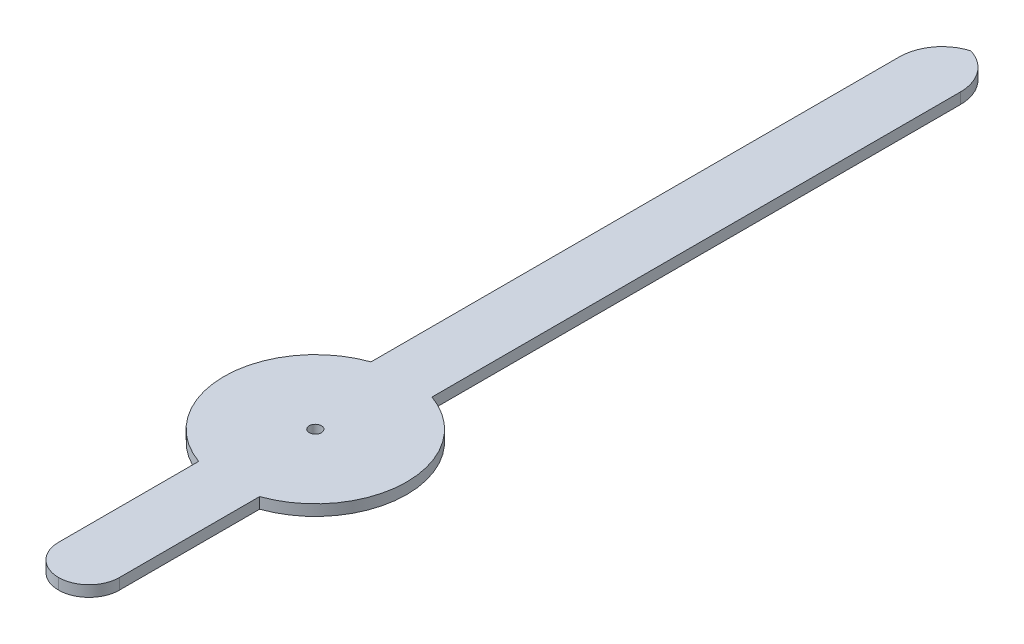
ISO-10303-21;
HEADER;
FILE_DESCRIPTION(('STEP AP214'),'2;1');
FILE_NAME('part.step','',(''),(''),'','','');
FILE_SCHEMA(('AUTOMOTIVE_DESIGN { 1 0 10303 214 1 1 1 1 }'));
ENDSEC;
DATA;
#1=APPLICATION_CONTEXT('core data for automotive mechanical design processes');
#2=APPLICATION_PROTOCOL_DEFINITION('international standard','automotive_design',2000,#1);
#3=PRODUCT_CONTEXT('',#1,'mechanical');
#4=PRODUCT('Part','Part','',(#3));
#5=PRODUCT_RELATED_PRODUCT_CATEGORY('part','',(#4));
#6=PRODUCT_DEFINITION_FORMATION('','',#4);
#7=PRODUCT_DEFINITION_CONTEXT('part definition',#1,'design');
#8=PRODUCT_DEFINITION('design','',#6,#7);
#9=PRODUCT_DEFINITION_SHAPE('','',#8);
#10=(LENGTH_UNIT() NAMED_UNIT(*) SI_UNIT(.MILLI.,.METRE.));
#11=(NAMED_UNIT(*) PLANE_ANGLE_UNIT() SI_UNIT($,.RADIAN.));
#12=(NAMED_UNIT(*) SI_UNIT($,.STERADIAN.) SOLID_ANGLE_UNIT());
#13=UNCERTAINTY_MEASURE_WITH_UNIT(LENGTH_MEASURE(1.E-05),#10,'distance_accuracy_value','');
#14=(GEOMETRIC_REPRESENTATION_CONTEXT(3) GLOBAL_UNCERTAINTY_ASSIGNED_CONTEXT((#13)) GLOBAL_UNIT_ASSIGNED_CONTEXT((#10,
#11,#12)) REPRESENTATION_CONTEXT('',''));
#15=CARTESIAN_POINT('',(0.,0.,0.));
#16=DIRECTION('',(0.,0.,1.));
#17=DIRECTION('',(1.,0.,0.));
#18=AXIS2_PLACEMENT_3D('',#15,#16,#17);
#19=CARTESIAN_POINT('',(0.,0.18,0.));
#20=DIRECTION('',(0.,1.,0.));
#21=DIRECTION('',(0.,0.,1.));
#22=AXIS2_PLACEMENT_3D('',#19,#20,#21);
#23=PLANE('',#22);
#24=CARTESIAN_POINT('',(-0.200000000000001,0.18,-10.0857864376269));
#25=DIRECTION('',(0.,1.,0.));
#26=DIRECTION('',(0.,0.,1.));
#27=AXIS2_PLACEMENT_3D('',#24,#25,#26);
#28=CIRCLE('',#27,0.7);
#29=CARTESIAN_POINT('',(0.499999999999999,0.18,-10.0857864376269));
#30=VERTEX_POINT('',#29);
#31=CARTESIAN_POINT('',(0.,0.18,-10.7566068308768));
#32=VERTEX_POINT('',#31);
#33=EDGE_CURVE('E60',#30,#32,#28,.T.);
#34=ORIENTED_EDGE('',*,*,#33,.T.);
#35=CARTESIAN_POINT('',(0.200000000000001,0.18,-10.0857864376269));
#36=DIRECTION('',(0.,1.,0.));
#37=DIRECTION('',(0.,0.,1.));
#38=AXIS2_PLACEMENT_3D('',#35,#36,#37);
#39=CIRCLE('',#38,0.7);
#40=CARTESIAN_POINT('',(-0.499999999999999,0.18,-10.0857864376269));
#41=VERTEX_POINT('',#40);
#42=EDGE_CURVE('E53',#32,#41,#39,.T.);
#43=ORIENTED_EDGE('',*,*,#42,.T.);
#44=DIRECTION('',(0.,0.,1.));
#45=VECTOR('',#44,1.);
#46=CARTESIAN_POINT('',(-0.499999999999999,0.18,-1.4142135623731));
#47=LINE('',#46,#45);
#48=CARTESIAN_POINT('',(-0.499999999999999,0.18,-1.4142135623731));
#49=VERTEX_POINT('',#48);
#50=EDGE_CURVE('E150',#41,#49,#47,.T.);
#51=ORIENTED_EDGE('',*,*,#50,.T.);
#52=CARTESIAN_POINT('',(0.,0.18,0.));
#53=DIRECTION('',(0.,1.,0.));
#54=DIRECTION('',(0.,0.,1.));
#55=AXIS2_PLACEMENT_3D('',#52,#53,#54);
#56=CIRCLE('',#55,1.5);
#57=CARTESIAN_POINT('',(-0.499999999999999,0.18,1.4142135623731));
#58=VERTEX_POINT('',#57);
#59=EDGE_CURVE('E156',#49,#58,#56,.T.);
#60=ORIENTED_EDGE('',*,*,#59,.T.);
#61=DIRECTION('',(0.,0.,1.));
#62=VECTOR('',#61,1.);
#63=CARTESIAN_POINT('',(-0.499999999999999,0.18,4.2142135623731));
#64=LINE('',#63,#62);
#65=CARTESIAN_POINT('',(-0.499999999999999,0.18,3.7142135623731));
#66=VERTEX_POINT('',#65);
#67=EDGE_CURVE('E159',#58,#66,#64,.T.);
#68=ORIENTED_EDGE('',*,*,#67,.T.);
#69=CARTESIAN_POINT('',(0.,0.18,3.7142135623731));
#70=DIRECTION('',(0.,1.,0.));
#71=DIRECTION('',(0.,0.,1.));
#72=AXIS2_PLACEMENT_3D('',#69,#70,#71);
#73=CIRCLE('',#72,0.5);
#74=CARTESIAN_POINT('',(0.,0.18,4.2142135623731));
#75=VERTEX_POINT('',#74);
#76=EDGE_CURVE('E202',#66,#75,#73,.T.);
#77=ORIENTED_EDGE('',*,*,#76,.T.);
#78=CARTESIAN_POINT('',(0.,0.18,3.7142135623731));
#79=DIRECTION('',(0.,1.,0.));
#80=DIRECTION('',(0.,0.,1.));
#81=AXIS2_PLACEMENT_3D('',#78,#79,#80);
#82=CIRCLE('',#81,0.5);
#83=CARTESIAN_POINT('',(0.499999999999999,0.18,3.7142135623731));
#84=VERTEX_POINT('',#83);
#85=EDGE_CURVE('E127',#75,#84,#82,.T.);
#86=ORIENTED_EDGE('',*,*,#85,.T.);
#87=DIRECTION('',(0.,0.,-1.));
#88=VECTOR('',#87,1.);
#89=CARTESIAN_POINT('',(0.499999999999999,0.18,4.2142135623731));
#90=LINE('',#89,#88);
#91=CARTESIAN_POINT('',(0.499999999999999,0.18,1.4142135623731));
#92=VERTEX_POINT('',#91);
#93=EDGE_CURVE('E120',#84,#92,#90,.T.);
#94=ORIENTED_EDGE('',*,*,#93,.T.);
#95=CARTESIAN_POINT('',(0.,0.18,0.));
#96=DIRECTION('',(0.,1.,0.));
#97=DIRECTION('',(0.,0.,1.));
#98=AXIS2_PLACEMENT_3D('',#95,#96,#97);
#99=CIRCLE('',#98,1.5);
#100=CARTESIAN_POINT('',(0.499999999999999,0.18,-1.4142135623731));
#101=VERTEX_POINT('',#100);
#102=EDGE_CURVE('E124',#92,#101,#99,.T.);
#103=ORIENTED_EDGE('',*,*,#102,.T.);
#104=DIRECTION('',(0.,0.,-1.));
#105=VECTOR('',#104,1.);
#106=CARTESIAN_POINT('',(0.499999999999999,0.18,-1.4142135623731));
#107=LINE('',#106,#105);
#108=EDGE_CURVE('E147',#101,#30,#107,.T.);
#109=ORIENTED_EDGE('',*,*,#108,.T.);
#110=EDGE_LOOP('',(#34,#43,#51,#60,#68,#77,#86,#94,#103,#109));
#111=FACE_BOUND('',#110,.T.);
#112=CARTESIAN_POINT('',(0.,0.18,0.));
#113=DIRECTION('',(0.,1.,0.));
#114=DIRECTION('',(0.,0.,1.));
#115=AXIS2_PLACEMENT_3D('',#112,#113,#114);
#116=CIRCLE('',#115,0.1);
#117=CARTESIAN_POINT('',(0.,0.18,0.1));
#118=VERTEX_POINT('',#117);
#119=EDGE_CURVE('E167',#118,#118,#116,.T.);
#120=ORIENTED_EDGE('',*,*,#119,.F.);
#121=EDGE_LOOP('',(#120));
#122=FACE_BOUND('',#121,.T.);
#123=ADVANCED_FACE('F43',(#111,#122),#23,.T.);
#124=CARTESIAN_POINT('',(0.,0.,0.));
#125=DIRECTION('',(0.,1.,0.));
#126=DIRECTION('',(0.,0.,1.));
#127=AXIS2_PLACEMENT_3D('',#124,#125,#126);
#128=PLANE('',#127);
#129=DIRECTION('',(0.,0.,1.));
#130=VECTOR('',#129,1.);
#131=CARTESIAN_POINT('',(-0.499999999999999,0.,-1.4142135623731));
#132=LINE('',#131,#130);
#133=CARTESIAN_POINT('',(-0.499999999999999,0.,-10.0857864376269));
#134=VERTEX_POINT('',#133);
#135=CARTESIAN_POINT('',(-0.499999999999999,0.,-1.4142135623731));
#136=VERTEX_POINT('',#135);
#137=EDGE_CURVE('E173',#134,#136,#132,.T.);
#138=ORIENTED_EDGE('',*,*,#137,.F.);
#139=CARTESIAN_POINT('',(0.200000000000001,0.,-10.0857864376269));
#140=DIRECTION('',(0.,1.,0.));
#141=DIRECTION('',(0.,0.,1.));
#142=AXIS2_PLACEMENT_3D('',#139,#140,#141);
#143=CIRCLE('',#142,0.7);
#144=CARTESIAN_POINT('',(0.,0.,-10.7566068308768));
#145=VERTEX_POINT('',#144);
#146=EDGE_CURVE('E220',#134,#145,#143,.F.);
#147=ORIENTED_EDGE('',*,*,#146,.T.);
#148=CARTESIAN_POINT('',(-0.200000000000001,0.,-10.0857864376269));
#149=DIRECTION('',(0.,1.,0.));
#150=DIRECTION('',(0.,0.,1.));
#151=AXIS2_PLACEMENT_3D('',#148,#149,#150);
#152=CIRCLE('',#151,0.7);
#153=CARTESIAN_POINT('',(0.499999999999999,0.,-10.0857864376269));
#154=VERTEX_POINT('',#153);
#155=EDGE_CURVE('E217',#145,#154,#152,.F.);
#156=ORIENTED_EDGE('',*,*,#155,.T.);
#157=DIRECTION('',(0.,0.,-1.));
#158=VECTOR('',#157,1.);
#159=CARTESIAN_POINT('',(0.499999999999999,0.,-1.4142135623731));
#160=LINE('',#159,#158);
#161=CARTESIAN_POINT('',(0.499999999999999,0.,-1.4142135623731));
#162=VERTEX_POINT('',#161);
#163=EDGE_CURVE('E170',#162,#154,#160,.T.);
#164=ORIENTED_EDGE('',*,*,#163,.F.);
#165=CARTESIAN_POINT('',(0.,0.,0.));
#166=DIRECTION('',(0.,1.,0.));
#167=DIRECTION('',(0.,0.,1.));
#168=AXIS2_PLACEMENT_3D('',#165,#166,#167);
#169=CIRCLE('',#168,1.5);
#170=CARTESIAN_POINT('',(0.499999999999999,0.,1.4142135623731));
#171=VERTEX_POINT('',#170);
#172=EDGE_CURVE('E166',#171,#162,#169,.T.);
#173=ORIENTED_EDGE('',*,*,#172,.F.);
#174=DIRECTION('',(0.,0.,-1.));
#175=VECTOR('',#174,1.);
#176=CARTESIAN_POINT('',(0.499999999999999,0.,4.2142135623731));
#177=LINE('',#176,#175);
#178=CARTESIAN_POINT('',(0.499999999999999,0.,3.7142135623731));
#179=VERTEX_POINT('',#178);
#180=EDGE_CURVE('E137',#179,#171,#177,.T.);
#181=ORIENTED_EDGE('',*,*,#180,.F.);
#182=CARTESIAN_POINT('',(0.,0.,3.7142135623731));
#183=DIRECTION('',(0.,1.,0.));
#184=DIRECTION('',(0.,0.,1.));
#185=AXIS2_PLACEMENT_3D('',#182,#183,#184);
#186=CIRCLE('',#185,0.5);
#187=CARTESIAN_POINT('',(0.,0.,4.2142135623731));
#188=VERTEX_POINT('',#187);
#189=EDGE_CURVE('E141',#179,#188,#186,.F.);
#190=ORIENTED_EDGE('',*,*,#189,.T.);
#191=CARTESIAN_POINT('',(0.,0.,3.7142135623731));
#192=DIRECTION('',(0.,1.,0.));
#193=DIRECTION('',(0.,0.,1.));
#194=AXIS2_PLACEMENT_3D('',#191,#192,#193);
#195=CIRCLE('',#194,0.5);
#196=CARTESIAN_POINT('',(-0.499999999999999,0.,3.7142135623731));
#197=VERTEX_POINT('',#196);
#198=EDGE_CURVE('E193',#188,#197,#195,.F.);
#199=ORIENTED_EDGE('',*,*,#198,.T.);
#200=DIRECTION('',(0.,0.,1.));
#201=VECTOR('',#200,1.);
#202=CARTESIAN_POINT('',(-0.499999999999999,0.,4.2142135623731));
#203=LINE('',#202,#201);
#204=CARTESIAN_POINT('',(-0.499999999999999,0.,1.4142135623731));
#205=VERTEX_POINT('',#204);
#206=EDGE_CURVE('E131',#205,#197,#203,.T.);
#207=ORIENTED_EDGE('',*,*,#206,.F.);
#208=CARTESIAN_POINT('',(0.,0.,0.));
#209=DIRECTION('',(0.,1.,0.));
#210=DIRECTION('',(0.,0.,1.));
#211=AXIS2_PLACEMENT_3D('',#208,#209,#210);
#212=CIRCLE('',#211,1.5);
#213=EDGE_CURVE('E176',#136,#205,#212,.T.);
#214=ORIENTED_EDGE('',*,*,#213,.F.);
#215=EDGE_LOOP('',(#138,#147,#156,#164,#173,#181,#190,#199,#207,#214));
#216=FACE_BOUND('',#215,.T.);
#217=CARTESIAN_POINT('',(0.,0.,0.));
#218=DIRECTION('',(0.,1.,0.));
#219=DIRECTION('',(0.,0.,1.));
#220=AXIS2_PLACEMENT_3D('',#217,#218,#219);
#221=CIRCLE('',#220,0.1);
#222=CARTESIAN_POINT('',(0.,0.,0.1));
#223=VERTEX_POINT('',#222);
#224=EDGE_CURVE('E213',#223,#223,#221,.T.);
#225=ORIENTED_EDGE('',*,*,#224,.T.);
#226=EDGE_LOOP('',(#225));
#227=FACE_BOUND('',#226,.T.);
#228=ADVANCED_FACE('F239',(#216,#227),#128,.F.);
#229=CARTESIAN_POINT('',(0.499999999999999,0.18,4.2142135623731));
#230=DIRECTION('',(-1.,0.,0.));
#231=DIRECTION('',(0.,0.,1.));
#232=AXIS2_PLACEMENT_3D('',#229,#230,#231);
#233=PLANE('',#232);
#234=ORIENTED_EDGE('',*,*,#93,.F.);
#235=DIRECTION('',(0.,-1.,0.));
#236=VECTOR('',#235,1.);
#237=CARTESIAN_POINT('',(0.499999999999999,0.18,3.7142135623731));
#238=LINE('',#237,#236);
#239=EDGE_CURVE('E205',#84,#179,#238,.T.);
#240=ORIENTED_EDGE('',*,*,#239,.T.);
#241=ORIENTED_EDGE('',*,*,#180,.T.);
#242=DIRECTION('',(0.,-1.,0.));
#243=VECTOR('',#242,1.);
#244=CARTESIAN_POINT('',(0.499999999999999,0.18,1.4142135623731));
#245=LINE('',#244,#243);
#246=EDGE_CURVE('E134',#92,#171,#245,.T.);
#247=ORIENTED_EDGE('',*,*,#246,.F.);
#248=EDGE_LOOP('',(#234,#240,#241,#247));
#249=FACE_BOUND('',#248,.T.);
#250=ADVANCED_FACE('F135',(#249),#233,.F.);
#251=CARTESIAN_POINT('',(0.,0.18,0.));
#252=DIRECTION('',(0.,-1.,0.));
#253=DIRECTION('',(0.,0.,-1.));
#254=AXIS2_PLACEMENT_3D('',#251,#252,#253);
#255=CYLINDRICAL_SURFACE('',#254,1.5);
#256=ORIENTED_EDGE('',*,*,#172,.T.);
#257=DIRECTION('',(0.,-1.,0.));
#258=VECTOR('',#257,1.);
#259=CARTESIAN_POINT('',(0.499999999999999,0.18,-1.4142135623731));
#260=LINE('',#259,#258);
#261=EDGE_CURVE('E142',#101,#162,#260,.T.);
#262=ORIENTED_EDGE('',*,*,#261,.F.);
#263=ORIENTED_EDGE('',*,*,#102,.F.);
#264=ORIENTED_EDGE('',*,*,#246,.T.);
#265=EDGE_LOOP('',(#256,#262,#263,#264));
#266=FACE_BOUND('',#265,.T.);
#267=ADVANCED_FACE('F144',(#266),#255,.T.);
#268=CARTESIAN_POINT('',(0.499999999999999,0.18,-1.4142135623731));
#269=DIRECTION('',(-1.,0.,0.));
#270=DIRECTION('',(0.,0.,1.));
#271=AXIS2_PLACEMENT_3D('',#268,#269,#270);
#272=PLANE('',#271);
#273=ORIENTED_EDGE('',*,*,#163,.T.);
#274=DIRECTION('',(0.,-1.,0.));
#275=VECTOR('',#274,1.);
#276=CARTESIAN_POINT('',(0.499999999999999,0.18,-10.0857864376269));
#277=LINE('',#276,#275);
#278=EDGE_CURVE('E11',#154,#30,#277,.F.);
#279=ORIENTED_EDGE('',*,*,#278,.T.);
#280=ORIENTED_EDGE('',*,*,#108,.F.);
#281=ORIENTED_EDGE('',*,*,#261,.T.);
#282=EDGE_LOOP('',(#273,#279,#280,#281));
#283=FACE_BOUND('',#282,.T.);
#284=ADVANCED_FACE('F272',(#283),#272,.F.);
#285=CARTESIAN_POINT('',(-0.499999999999999,0.18,-1.4142135623731));
#286=DIRECTION('',(1.,0.,0.));
#287=DIRECTION('',(0.,0.,-1.));
#288=AXIS2_PLACEMENT_3D('',#285,#286,#287);
#289=PLANE('',#288);
#290=ORIENTED_EDGE('',*,*,#50,.F.);
#291=DIRECTION('',(0.,-1.,0.));
#292=VECTOR('',#291,1.);
#293=CARTESIAN_POINT('',(-0.499999999999999,0.18,-10.0857864376269));
#294=LINE('',#293,#292);
#295=EDGE_CURVE('E208',#41,#134,#294,.T.);
#296=ORIENTED_EDGE('',*,*,#295,.T.);
#297=ORIENTED_EDGE('',*,*,#137,.T.);
#298=DIRECTION('',(0.,-1.,0.));
#299=VECTOR('',#298,1.);
#300=CARTESIAN_POINT('',(-0.499999999999999,0.18,-1.4142135623731));
#301=LINE('',#300,#299);
#302=EDGE_CURVE('E185',#49,#136,#301,.T.);
#303=ORIENTED_EDGE('',*,*,#302,.F.);
#304=EDGE_LOOP('',(#290,#296,#297,#303));
#305=FACE_BOUND('',#304,.T.);
#306=ADVANCED_FACE('F233',(#305),#289,.F.);
#307=CARTESIAN_POINT('',(0.,0.18,0.));
#308=DIRECTION('',(0.,-1.,0.));
#309=DIRECTION('',(0.,0.,-1.));
#310=AXIS2_PLACEMENT_3D('',#307,#308,#309);
#311=CYLINDRICAL_SURFACE('',#310,1.5);
#312=ORIENTED_EDGE('',*,*,#213,.T.);
#313=DIRECTION('',(0.,-1.,0.));
#314=VECTOR('',#313,1.);
#315=CARTESIAN_POINT('',(-0.499999999999999,0.18,1.4142135623731));
#316=LINE('',#315,#314);
#317=EDGE_CURVE('E163',#58,#205,#316,.T.);
#318=ORIENTED_EDGE('',*,*,#317,.F.);
#319=ORIENTED_EDGE('',*,*,#59,.F.);
#320=ORIENTED_EDGE('',*,*,#302,.T.);
#321=EDGE_LOOP('',(#312,#318,#319,#320));
#322=FACE_BOUND('',#321,.T.);
#323=ADVANCED_FACE('F265',(#322),#311,.T.);
#324=CARTESIAN_POINT('',(-0.499999999999999,0.18,4.2142135623731));
#325=DIRECTION('',(1.,0.,0.));
#326=DIRECTION('',(0.,0.,-1.));
#327=AXIS2_PLACEMENT_3D('',#324,#325,#326);
#328=PLANE('',#327);
#329=ORIENTED_EDGE('',*,*,#206,.T.);
#330=DIRECTION('',(0.,-1.,0.));
#331=VECTOR('',#330,1.);
#332=CARTESIAN_POINT('',(-0.499999999999999,0.18,3.7142135623731));
#333=LINE('',#332,#331);
#334=EDGE_CURVE('E196',#197,#66,#333,.F.);
#335=ORIENTED_EDGE('',*,*,#334,.T.);
#336=ORIENTED_EDGE('',*,*,#67,.F.);
#337=ORIENTED_EDGE('',*,*,#317,.T.);
#338=EDGE_LOOP('',(#329,#335,#336,#337));
#339=FACE_BOUND('',#338,.T.);
#340=ADVANCED_FACE('F262',(#339),#328,.F.);
#341=CARTESIAN_POINT('',(0.,0.18,0.));
#342=DIRECTION('',(0.,-1.,0.));
#343=DIRECTION('',(0.,0.,-1.));
#344=AXIS2_PLACEMENT_3D('',#341,#342,#343);
#345=CYLINDRICAL_SURFACE('',#344,0.1);
#346=ORIENTED_EDGE('',*,*,#119,.T.);
#347=EDGE_LOOP('',(#346));
#348=FACE_BOUND('',#347,.T.);
#349=ORIENTED_EDGE('',*,*,#224,.F.);
#350=EDGE_LOOP('',(#349));
#351=FACE_BOUND('',#350,.T.);
#352=ADVANCED_FACE('F252',(#348,#351),#345,.F.);
#353=CARTESIAN_POINT('',(0.,0.18,3.7142135623731));
#354=DIRECTION('',(0.,-1.,0.));
#355=DIRECTION('',(0.,0.,-1.));
#356=AXIS2_PLACEMENT_3D('',#353,#354,#355);
#357=CYLINDRICAL_SURFACE('',#356,0.5);
#358=ORIENTED_EDGE('',*,*,#239,.F.);
#359=ORIENTED_EDGE('',*,*,#85,.F.);
#360=DIRECTION('',(0.,-1.,0.));
#361=VECTOR('',#360,1.);
#362=CARTESIAN_POINT('',(0.,0.18,4.2142135623731));
#363=LINE('',#362,#361);
#364=EDGE_CURVE('E209',#188,#75,#363,.F.);
#365=ORIENTED_EDGE('',*,*,#364,.F.);
#366=ORIENTED_EDGE('',*,*,#189,.F.);
#367=EDGE_LOOP('',(#358,#359,#365,#366));
#368=FACE_BOUND('',#367,.T.);
#369=ADVANCED_FACE('F282',(#368),#357,.T.);
#370=CARTESIAN_POINT('',(0.,0.18,3.7142135623731));
#371=DIRECTION('',(0.,-1.,0.));
#372=DIRECTION('',(0.,0.,-1.));
#373=AXIS2_PLACEMENT_3D('',#370,#371,#372);
#374=CYLINDRICAL_SURFACE('',#373,0.5);
#375=ORIENTED_EDGE('',*,*,#76,.F.);
#376=ORIENTED_EDGE('',*,*,#334,.F.);
#377=ORIENTED_EDGE('',*,*,#198,.F.);
#378=ORIENTED_EDGE('',*,*,#364,.T.);
#379=EDGE_LOOP('',(#375,#376,#377,#378));
#380=FACE_BOUND('',#379,.T.);
#381=ADVANCED_FACE('F279',(#380),#374,.T.);
#382=CARTESIAN_POINT('',(-0.200000000000001,0.18,-10.0857864376269));
#383=DIRECTION('',(0.,-1.,0.));
#384=DIRECTION('',(0.,0.,-1.));
#385=AXIS2_PLACEMENT_3D('',#382,#383,#384);
#386=CYLINDRICAL_SURFACE('',#385,0.7);
#387=DIRECTION('',(0.,-1.,0.));
#388=VECTOR('',#387,1.);
#389=CARTESIAN_POINT('',(0.,0.09,-10.7566068308768));
#390=LINE('',#389,#388);
#391=EDGE_CURVE('E47',#32,#145,#390,.T.);
#392=ORIENTED_EDGE('',*,*,#391,.F.);
#393=ORIENTED_EDGE('',*,*,#33,.F.);
#394=ORIENTED_EDGE('',*,*,#278,.F.);
#395=ORIENTED_EDGE('',*,*,#155,.F.);
#396=EDGE_LOOP('',(#392,#393,#394,#395));
#397=FACE_BOUND('',#396,.T.);
#398=ADVANCED_FACE('F45',(#397),#386,.T.);
#399=CARTESIAN_POINT('',(0.200000000000001,0.18,-10.0857864376269));
#400=DIRECTION('',(0.,-1.,0.));
#401=DIRECTION('',(0.,0.,-1.));
#402=AXIS2_PLACEMENT_3D('',#399,#400,#401);
#403=CYLINDRICAL_SURFACE('',#402,0.7);
#404=ORIENTED_EDGE('',*,*,#42,.F.);
#405=ORIENTED_EDGE('',*,*,#391,.T.);
#406=ORIENTED_EDGE('',*,*,#146,.F.);
#407=ORIENTED_EDGE('',*,*,#295,.F.);
#408=EDGE_LOOP('',(#404,#405,#406,#407));
#409=FACE_BOUND('',#408,.T.);
#410=ADVANCED_FACE('F236',(#409),#403,.T.);
#411=CLOSED_SHELL('',(#123,#228,#250,#267,#284,#306,#323,#340,#352,#369,#381,#398,#410));
#412=MANIFOLD_SOLID_BREP('B2',#411);
#413=ADVANCED_BREP_SHAPE_REPRESENTATION('',(#18,#412),#14);
#414=SHAPE_DEFINITION_REPRESENTATION(#9,#413);
ENDSEC;
END-ISO-10303-21;
